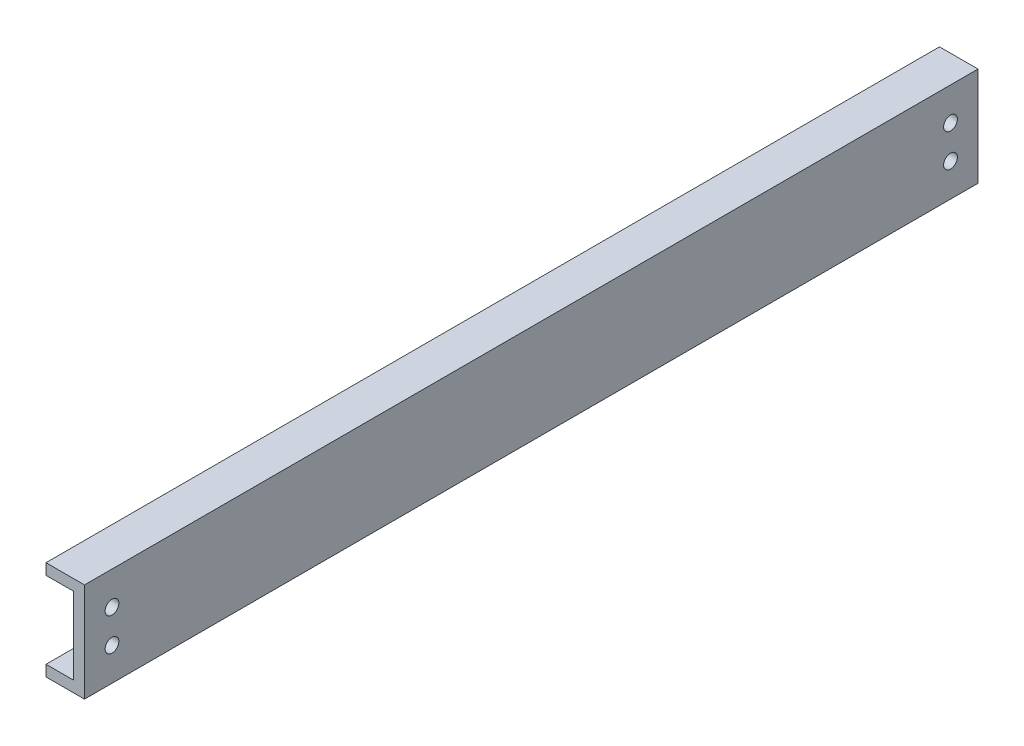
ISO-10303-21;
HEADER;
FILE_DESCRIPTION(('STEP AP214'),'2;1');
FILE_NAME('part.step','',(''),(''),'','','');
FILE_SCHEMA(('AUTOMOTIVE_DESIGN { 1 0 10303 214 1 1 1 1 }'));
ENDSEC;
DATA;
#1=APPLICATION_CONTEXT('core data for automotive mechanical design processes');
#2=APPLICATION_PROTOCOL_DEFINITION('international standard','automotive_design',2000,#1);
#3=PRODUCT_CONTEXT('',#1,'mechanical');
#4=PRODUCT('Part','Part','',(#3));
#5=PRODUCT_RELATED_PRODUCT_CATEGORY('part','',(#4));
#6=PRODUCT_DEFINITION_FORMATION('','',#4);
#7=PRODUCT_DEFINITION_CONTEXT('part definition',#1,'design');
#8=PRODUCT_DEFINITION('design','',#6,#7);
#9=PRODUCT_DEFINITION_SHAPE('','',#8);
#10=(LENGTH_UNIT() NAMED_UNIT(*) SI_UNIT(.MILLI.,.METRE.));
#11=(NAMED_UNIT(*) PLANE_ANGLE_UNIT() SI_UNIT($,.RADIAN.));
#12=(NAMED_UNIT(*) SI_UNIT($,.STERADIAN.) SOLID_ANGLE_UNIT());
#13=UNCERTAINTY_MEASURE_WITH_UNIT(LENGTH_MEASURE(1.E-05),#10,'distance_accuracy_value','');
#14=(GEOMETRIC_REPRESENTATION_CONTEXT(3) GLOBAL_UNCERTAINTY_ASSIGNED_CONTEXT((#13)) GLOBAL_UNIT_ASSIGNED_CONTEXT((#10,
#11,#12)) REPRESENTATION_CONTEXT('',''));
#15=CARTESIAN_POINT('',(0.,0.,0.));
#16=DIRECTION('',(0.,0.,1.));
#17=DIRECTION('',(1.,0.,0.));
#18=AXIS2_PLACEMENT_3D('',#15,#16,#17);
#19=CARTESIAN_POINT('',(-7.,9.88828278471343,-162.5));
#20=DIRECTION('',(-1.,0.,0.));
#21=DIRECTION('',(0.,0.,1.));
#22=AXIS2_PLACEMENT_3D('',#19,#20,#21);
#23=PLANE('',#22);
#24=DIRECTION('',(0.,-1.,0.));
#25=VECTOR('',#24,1.);
#26=CARTESIAN_POINT('',(-7.,9.88828278471343,0.));
#27=LINE('',#26,#25);
#28=CARTESIAN_POINT('',(-7.,9.88828278471343,0.));
#29=VERTEX_POINT('',#28);
#30=CARTESIAN_POINT('',(-7.,7.88828278471343,0.));
#31=VERTEX_POINT('',#30);
#32=EDGE_CURVE('E135',#29,#31,#27,.T.);
#33=ORIENTED_EDGE('',*,*,#32,.F.);
#34=DIRECTION('',(0.,0.,1.));
#35=VECTOR('',#34,1.);
#36=CARTESIAN_POINT('',(-7.,9.88828278471343,-162.5));
#37=LINE('',#36,#35);
#38=CARTESIAN_POINT('',(-7.,9.88828278471343,-162.5));
#39=VERTEX_POINT('',#38);
#40=EDGE_CURVE('E11',#39,#29,#37,.T.);
#41=ORIENTED_EDGE('',*,*,#40,.F.);
#42=DIRECTION('',(0.,-1.,0.));
#43=VECTOR('',#42,1.);
#44=CARTESIAN_POINT('',(-7.,9.88828278471343,-162.5));
#45=LINE('',#44,#43);
#46=CARTESIAN_POINT('',(-7.,7.88828278471343,-162.5));
#47=VERTEX_POINT('',#46);
#48=EDGE_CURVE('E156',#39,#47,#45,.T.);
#49=ORIENTED_EDGE('',*,*,#48,.T.);
#50=DIRECTION('',(0.,0.,1.));
#51=VECTOR('',#50,1.);
#52=CARTESIAN_POINT('',(-7.,7.88828278471343,-162.5));
#53=LINE('',#52,#51);
#54=EDGE_CURVE('E93',#47,#31,#53,.T.);
#55=ORIENTED_EDGE('',*,*,#54,.T.);
#56=EDGE_LOOP('',(#33,#41,#49,#55));
#57=FACE_BOUND('',#56,.T.);
#58=ADVANCED_FACE('F37',(#57),#23,.T.);
#59=CARTESIAN_POINT('',(-7.,9.88828278471343,-162.5));
#60=DIRECTION('',(0.,1.,0.));
#61=DIRECTION('',(-1.,0.,0.));
#62=AXIS2_PLACEMENT_3D('',#59,#60,#61);
#63=PLANE('',#62);
#64=DIRECTION('',(-1.,0.,0.));
#65=VECTOR('',#64,1.);
#66=CARTESIAN_POINT('',(-7.,9.88828278471343,0.));
#67=LINE('',#66,#65);
#68=CARTESIAN_POINT('',(0.,9.88828278471343,0.));
#69=VERTEX_POINT('',#68);
#70=EDGE_CURVE('E154',#69,#29,#67,.T.);
#71=ORIENTED_EDGE('',*,*,#70,.F.);
#72=DIRECTION('',(0.,0.,1.));
#73=VECTOR('',#72,1.);
#74=CARTESIAN_POINT('',(0.,9.88828278471343,-162.5));
#75=LINE('',#74,#73);
#76=CARTESIAN_POINT('',(0.,9.88828278471343,-162.5));
#77=VERTEX_POINT('',#76);
#78=EDGE_CURVE('E46',#77,#69,#75,.T.);
#79=ORIENTED_EDGE('',*,*,#78,.F.);
#80=DIRECTION('',(-1.,0.,0.));
#81=VECTOR('',#80,1.);
#82=CARTESIAN_POINT('',(-7.,9.88828278471343,-162.5));
#83=LINE('',#82,#81);
#84=EDGE_CURVE('E125',#77,#39,#83,.T.);
#85=ORIENTED_EDGE('',*,*,#84,.T.);
#86=ORIENTED_EDGE('',*,*,#40,.T.);
#87=EDGE_LOOP('',(#71,#79,#85,#86));
#88=FACE_BOUND('',#87,.T.);
#89=ADVANCED_FACE('F223',(#88),#63,.T.);
#90=CARTESIAN_POINT('',(0.,9.88828278471343,-162.5));
#91=DIRECTION('',(1.,0.,0.));
#92=DIRECTION('',(0.,1.,0.));
#93=AXIS2_PLACEMENT_3D('',#90,#91,#92);
#94=PLANE('',#93);
#95=CARTESIAN_POINT('',(0.,3.88828278471345,-157.5));
#96=DIRECTION('',(1.,0.,0.));
#97=DIRECTION('',(0.,-1.,0.));
#98=AXIS2_PLACEMENT_3D('',#95,#96,#97);
#99=CIRCLE('',#98,1.25000000000004);
#100=CARTESIAN_POINT('',(0.,2.63828278471341,-157.5));
#101=VERTEX_POINT('',#100);
#102=EDGE_CURVE('E190',#101,#101,#99,.T.);
#103=ORIENTED_EDGE('',*,*,#102,.F.);
#104=EDGE_LOOP('',(#103));
#105=FACE_BOUND('',#104,.T.);
#106=CARTESIAN_POINT('',(0.,-2.11171721528655,-157.5));
#107=DIRECTION('',(1.,0.,0.));
#108=DIRECTION('',(0.,1.,0.));
#109=AXIS2_PLACEMENT_3D('',#106,#107,#108);
#110=CIRCLE('',#109,1.25000000000004);
#111=CARTESIAN_POINT('',(0.,-0.861717215286511,-157.5));
#112=VERTEX_POINT('',#111);
#113=EDGE_CURVE('E194',#112,#112,#110,.T.);
#114=ORIENTED_EDGE('',*,*,#113,.F.);
#115=EDGE_LOOP('',(#114));
#116=FACE_BOUND('',#115,.T.);
#117=CARTESIAN_POINT('',(0.,-2.11171721528657,-5.));
#118=DIRECTION('',(1.,0.,0.));
#119=DIRECTION('',(0.,-1.,0.));
#120=AXIS2_PLACEMENT_3D('',#117,#118,#119);
#121=CIRCLE('',#120,1.25);
#122=CARTESIAN_POINT('',(0.,-3.36171721528657,-5.));
#123=VERTEX_POINT('',#122);
#124=EDGE_CURVE('E199',#123,#123,#121,.T.);
#125=ORIENTED_EDGE('',*,*,#124,.F.);
#126=EDGE_LOOP('',(#125));
#127=FACE_BOUND('',#126,.T.);
#128=CARTESIAN_POINT('',(0.,3.88828278471343,-5.));
#129=DIRECTION('',(1.,0.,0.));
#130=DIRECTION('',(0.,1.,0.));
#131=AXIS2_PLACEMENT_3D('',#128,#129,#130);
#132=CIRCLE('',#131,1.25);
#133=CARTESIAN_POINT('',(0.,5.13828278471343,-5.));
#134=VERTEX_POINT('',#133);
#135=EDGE_CURVE('E171',#134,#134,#132,.T.);
#136=ORIENTED_EDGE('',*,*,#135,.F.);
#137=EDGE_LOOP('',(#136));
#138=FACE_BOUND('',#137,.T.);
#139=DIRECTION('',(0.,1.,0.));
#140=VECTOR('',#139,1.);
#141=CARTESIAN_POINT('',(0.,9.88828278471343,0.));
#142=LINE('',#141,#140);
#143=CARTESIAN_POINT('',(0.,-8.11171721528657,0.));
#144=VERTEX_POINT('',#143);
#145=EDGE_CURVE('E112',#144,#69,#142,.T.);
#146=ORIENTED_EDGE('',*,*,#145,.F.);
#147=DIRECTION('',(0.,0.,1.));
#148=VECTOR('',#147,1.);
#149=CARTESIAN_POINT('',(0.,-8.11171721528657,-162.5));
#150=LINE('',#149,#148);
#151=CARTESIAN_POINT('',(0.,-8.11171721528657,-162.5));
#152=VERTEX_POINT('',#151);
#153=EDGE_CURVE('E107',#152,#144,#150,.T.);
#154=ORIENTED_EDGE('',*,*,#153,.F.);
#155=DIRECTION('',(0.,1.,0.));
#156=VECTOR('',#155,1.);
#157=CARTESIAN_POINT('',(0.,9.88828278471343,-162.5));
#158=LINE('',#157,#156);
#159=EDGE_CURVE('E110',#152,#77,#158,.T.);
#160=ORIENTED_EDGE('',*,*,#159,.T.);
#161=ORIENTED_EDGE('',*,*,#78,.T.);
#162=EDGE_LOOP('',(#146,#154,#160,#161));
#163=FACE_BOUND('',#162,.T.);
#164=ADVANCED_FACE('F109',(#105,#116,#127,#138,#163),#94,.T.);
#165=CARTESIAN_POINT('',(0.,-8.11171721528657,-162.5));
#166=DIRECTION('',(0.,-1.,0.));
#167=DIRECTION('',(1.,0.,0.));
#168=AXIS2_PLACEMENT_3D('',#165,#166,#167);
#169=PLANE('',#168);
#170=CARTESIAN_POINT('',(-4.5,-8.11171721528657,-37.));
#171=DIRECTION('',(0.,-1.,0.));
#172=DIRECTION('',(1.,0.,0.));
#173=AXIS2_PLACEMENT_3D('',#170,#171,#172);
#174=CIRCLE('',#173,1.25);
#175=CARTESIAN_POINT('',(-3.25,-8.11171721528657,-37.));
#176=VERTEX_POINT('',#175);
#177=EDGE_CURVE('E183',#176,#176,#174,.T.);
#178=ORIENTED_EDGE('',*,*,#177,.F.);
#179=EDGE_LOOP('',(#178));
#180=FACE_BOUND('',#179,.T.);
#181=CARTESIAN_POINT('',(-4.5,-8.11171721528657,-43.));
#182=DIRECTION('',(0.,-1.,0.));
#183=DIRECTION('',(-1.,0.,0.));
#184=AXIS2_PLACEMENT_3D('',#181,#182,#183);
#185=CIRCLE('',#184,1.25);
#186=CARTESIAN_POINT('',(-5.75,-8.11171721528657,-43.));
#187=VERTEX_POINT('',#186);
#188=EDGE_CURVE('E289',#187,#187,#185,.T.);
#189=ORIENTED_EDGE('',*,*,#188,.F.);
#190=EDGE_LOOP('',(#189));
#191=FACE_BOUND('',#190,.T.);
#192=CARTESIAN_POINT('',(-4.49999999999999,-8.11171721528657,-112.));
#193=DIRECTION('',(0.,-1.,0.));
#194=DIRECTION('',(1.,0.,0.));
#195=AXIS2_PLACEMENT_3D('',#192,#193,#194);
#196=CIRCLE('',#195,1.25);
#197=CARTESIAN_POINT('',(-3.24999999999999,-8.11171721528657,-112.));
#198=VERTEX_POINT('',#197);
#199=EDGE_CURVE('E292',#198,#198,#196,.T.);
#200=ORIENTED_EDGE('',*,*,#199,.F.);
#201=EDGE_LOOP('',(#200));
#202=FACE_BOUND('',#201,.T.);
#203=CARTESIAN_POINT('',(-4.49999999999999,-8.11171721528657,-118.));
#204=DIRECTION('',(0.,-1.,0.));
#205=DIRECTION('',(-1.,0.,0.));
#206=AXIS2_PLACEMENT_3D('',#203,#204,#205);
#207=CIRCLE('',#206,1.25);
#208=CARTESIAN_POINT('',(-5.74999999999999,-8.11171721528657,-118.));
#209=VERTEX_POINT('',#208);
#210=EDGE_CURVE('E297',#209,#209,#207,.T.);
#211=ORIENTED_EDGE('',*,*,#210,.F.);
#212=EDGE_LOOP('',(#211));
#213=FACE_BOUND('',#212,.T.);
#214=DIRECTION('',(1.,0.,0.));
#215=VECTOR('',#214,1.);
#216=CARTESIAN_POINT('',(0.,-8.11171721528657,0.));
#217=LINE('',#216,#215);
#218=CARTESIAN_POINT('',(-7.,-8.11171721528657,0.));
#219=VERTEX_POINT('',#218);
#220=EDGE_CURVE('E151',#219,#144,#217,.T.);
#221=ORIENTED_EDGE('',*,*,#220,.F.);
#222=DIRECTION('',(0.,0.,1.));
#223=VECTOR('',#222,1.);
#224=CARTESIAN_POINT('',(-7.,-8.11171721528657,-162.5));
#225=LINE('',#224,#223);
#226=CARTESIAN_POINT('',(-7.,-8.11171721528657,-162.5));
#227=VERTEX_POINT('',#226);
#228=EDGE_CURVE('E117',#227,#219,#225,.T.);
#229=ORIENTED_EDGE('',*,*,#228,.F.);
#230=DIRECTION('',(1.,0.,0.));
#231=VECTOR('',#230,1.);
#232=CARTESIAN_POINT('',(0.,-8.11171721528657,-162.5));
#233=LINE('',#232,#231);
#234=EDGE_CURVE('E123',#227,#152,#233,.T.);
#235=ORIENTED_EDGE('',*,*,#234,.T.);
#236=ORIENTED_EDGE('',*,*,#153,.T.);
#237=EDGE_LOOP('',(#221,#229,#235,#236));
#238=FACE_BOUND('',#237,.T.);
#239=ADVANCED_FACE('F127',(#180,#191,#202,#213,#238),#169,.T.);
#240=CARTESIAN_POINT('',(-7.,-8.11171721528657,-162.5));
#241=DIRECTION('',(-1.,0.,0.));
#242=DIRECTION('',(0.,0.,1.));
#243=AXIS2_PLACEMENT_3D('',#240,#241,#242);
#244=PLANE('',#243);
#245=DIRECTION('',(0.,-1.,0.));
#246=VECTOR('',#245,1.);
#247=CARTESIAN_POINT('',(-7.,-8.11171721528657,0.));
#248=LINE('',#247,#246);
#249=CARTESIAN_POINT('',(-7.,-6.11171721528657,0.));
#250=VERTEX_POINT('',#249);
#251=EDGE_CURVE('E148',#250,#219,#248,.T.);
#252=ORIENTED_EDGE('',*,*,#251,.F.);
#253=DIRECTION('',(0.,0.,1.));
#254=VECTOR('',#253,1.);
#255=CARTESIAN_POINT('',(-7.,-6.11171721528657,-162.5));
#256=LINE('',#255,#254);
#257=CARTESIAN_POINT('',(-7.,-6.11171721528657,-162.5));
#258=VERTEX_POINT('',#257);
#259=EDGE_CURVE('E160',#258,#250,#256,.T.);
#260=ORIENTED_EDGE('',*,*,#259,.F.);
#261=DIRECTION('',(0.,-1.,0.));
#262=VECTOR('',#261,1.);
#263=CARTESIAN_POINT('',(-7.,-8.11171721528657,-162.5));
#264=LINE('',#263,#262);
#265=EDGE_CURVE('E128',#258,#227,#264,.T.);
#266=ORIENTED_EDGE('',*,*,#265,.T.);
#267=ORIENTED_EDGE('',*,*,#228,.T.);
#268=EDGE_LOOP('',(#252,#260,#266,#267));
#269=FACE_BOUND('',#268,.T.);
#270=ADVANCED_FACE('F237',(#269),#244,.T.);
#271=CARTESIAN_POINT('',(-2.,-6.11171721528657,-162.5));
#272=DIRECTION('',(0.,1.,0.));
#273=DIRECTION('',(0.,0.,1.));
#274=AXIS2_PLACEMENT_3D('',#271,#272,#273);
#275=PLANE('',#274);
#276=CARTESIAN_POINT('',(-4.49999999999999,-6.11171721528657,-37.));
#277=DIRECTION('',(0.,1.,0.));
#278=DIRECTION('',(0.,0.,1.));
#279=AXIS2_PLACEMENT_3D('',#276,#277,#278);
#280=CIRCLE('',#279,1.25);
#281=CARTESIAN_POINT('',(-4.49999999999999,-6.11171721528657,-35.75));
#282=VERTEX_POINT('',#281);
#283=EDGE_CURVE('E40',#282,#282,#280,.T.);
#284=ORIENTED_EDGE('',*,*,#283,.F.);
#285=EDGE_LOOP('',(#284));
#286=FACE_BOUND('',#285,.T.);
#287=CARTESIAN_POINT('',(-4.49999999999999,-6.11171721528657,-43.));
#288=DIRECTION('',(0.,1.,0.));
#289=DIRECTION('',(0.,0.,1.));
#290=AXIS2_PLACEMENT_3D('',#287,#288,#289);
#291=CIRCLE('',#290,1.25);
#292=CARTESIAN_POINT('',(-4.49999999999999,-6.11171721528657,-41.75));
#293=VERTEX_POINT('',#292);
#294=EDGE_CURVE('E185',#293,#293,#291,.T.);
#295=ORIENTED_EDGE('',*,*,#294,.F.);
#296=EDGE_LOOP('',(#295));
#297=FACE_BOUND('',#296,.T.);
#298=CARTESIAN_POINT('',(-4.49999999999998,-6.11171721528657,-112.));
#299=DIRECTION('',(0.,1.,0.));
#300=DIRECTION('',(0.,0.,1.));
#301=AXIS2_PLACEMENT_3D('',#298,#299,#300);
#302=CIRCLE('',#301,1.25);
#303=CARTESIAN_POINT('',(-4.49999999999998,-6.11171721528657,-110.75));
#304=VERTEX_POINT('',#303);
#305=EDGE_CURVE('E182',#304,#304,#302,.T.);
#306=ORIENTED_EDGE('',*,*,#305,.F.);
#307=EDGE_LOOP('',(#306));
#308=FACE_BOUND('',#307,.T.);
#309=CARTESIAN_POINT('',(-4.49999999999998,-6.11171721528657,-118.));
#310=DIRECTION('',(0.,1.,0.));
#311=DIRECTION('',(0.,0.,1.));
#312=AXIS2_PLACEMENT_3D('',#309,#310,#311);
#313=CIRCLE('',#312,1.25);
#314=CARTESIAN_POINT('',(-4.49999999999998,-6.11171721528657,-116.75));
#315=VERTEX_POINT('',#314);
#316=EDGE_CURVE('E179',#315,#315,#313,.T.);
#317=ORIENTED_EDGE('',*,*,#316,.F.);
#318=EDGE_LOOP('',(#317));
#319=FACE_BOUND('',#318,.T.);
#320=DIRECTION('',(-1.,0.,0.));
#321=VECTOR('',#320,1.);
#322=CARTESIAN_POINT('',(-2.,-6.11171721528657,0.));
#323=LINE('',#322,#321);
#324=CARTESIAN_POINT('',(-2.,-6.11171721528657,0.));
#325=VERTEX_POINT('',#324);
#326=EDGE_CURVE('E145',#325,#250,#323,.T.);
#327=ORIENTED_EDGE('',*,*,#326,.F.);
#328=DIRECTION('',(0.,0.,1.));
#329=VECTOR('',#328,1.);
#330=CARTESIAN_POINT('',(-2.,-6.11171721528657,-162.5));
#331=LINE('',#330,#329);
#332=CARTESIAN_POINT('',(-2.,-6.11171721528657,-162.5));
#333=VERTEX_POINT('',#332);
#334=EDGE_CURVE('E162',#333,#325,#331,.T.);
#335=ORIENTED_EDGE('',*,*,#334,.F.);
#336=DIRECTION('',(-1.,0.,0.));
#337=VECTOR('',#336,1.);
#338=CARTESIAN_POINT('',(-2.,-6.11171721528657,-162.5));
#339=LINE('',#338,#337);
#340=EDGE_CURVE('E130',#333,#258,#339,.T.);
#341=ORIENTED_EDGE('',*,*,#340,.T.);
#342=ORIENTED_EDGE('',*,*,#259,.T.);
#343=EDGE_LOOP('',(#327,#335,#341,#342));
#344=FACE_BOUND('',#343,.T.);
#345=ADVANCED_FACE('F214',(#286,#297,#308,#319,#344),#275,.T.);
#346=CARTESIAN_POINT('',(-2.,7.88828278471343,-162.5));
#347=DIRECTION('',(-1.,0.,0.));
#348=DIRECTION('',(0.,-1.,0.));
#349=AXIS2_PLACEMENT_3D('',#346,#347,#348);
#350=PLANE('',#349);
#351=CARTESIAN_POINT('',(-2.,3.88828278471345,-157.5));
#352=DIRECTION('',(-1.,0.,0.));
#353=DIRECTION('',(0.,-1.,0.));
#354=AXIS2_PLACEMENT_3D('',#351,#352,#353);
#355=CIRCLE('',#354,1.25000000000004);
#356=CARTESIAN_POINT('',(-2.,2.63828278471341,-157.5));
#357=VERTEX_POINT('',#356);
#358=EDGE_CURVE('E139',#357,#357,#355,.T.);
#359=ORIENTED_EDGE('',*,*,#358,.F.);
#360=EDGE_LOOP('',(#359));
#361=FACE_BOUND('',#360,.T.);
#362=CARTESIAN_POINT('',(-2.,-2.11171721528655,-157.5));
#363=DIRECTION('',(-1.,0.,0.));
#364=DIRECTION('',(0.,-1.,0.));
#365=AXIS2_PLACEMENT_3D('',#362,#363,#364);
#366=CIRCLE('',#365,1.25000000000004);
#367=CARTESIAN_POINT('',(-2.,-3.36171721528659,-157.5));
#368=VERTEX_POINT('',#367);
#369=EDGE_CURVE('E174',#368,#368,#366,.T.);
#370=ORIENTED_EDGE('',*,*,#369,.F.);
#371=EDGE_LOOP('',(#370));
#372=FACE_BOUND('',#371,.T.);
#373=CARTESIAN_POINT('',(-2.,-2.11171721528657,-5.));
#374=DIRECTION('',(-1.,0.,0.));
#375=DIRECTION('',(0.,-1.,0.));
#376=AXIS2_PLACEMENT_3D('',#373,#374,#375);
#377=CIRCLE('',#376,1.25);
#378=CARTESIAN_POINT('',(-2.,-3.36171721528657,-5.));
#379=VERTEX_POINT('',#378);
#380=EDGE_CURVE('E170',#379,#379,#377,.T.);
#381=ORIENTED_EDGE('',*,*,#380,.F.);
#382=EDGE_LOOP('',(#381));
#383=FACE_BOUND('',#382,.T.);
#384=CARTESIAN_POINT('',(-2.,3.88828278471343,-5.));
#385=DIRECTION('',(-1.,0.,0.));
#386=DIRECTION('',(0.,-1.,0.));
#387=AXIS2_PLACEMENT_3D('',#384,#385,#386);
#388=CIRCLE('',#387,1.25);
#389=CARTESIAN_POINT('',(-2.,2.63828278471343,-5.));
#390=VERTEX_POINT('',#389);
#391=EDGE_CURVE('E167',#390,#390,#388,.T.);
#392=ORIENTED_EDGE('',*,*,#391,.F.);
#393=EDGE_LOOP('',(#392));
#394=FACE_BOUND('',#393,.T.);
#395=DIRECTION('',(0.,-1.,0.));
#396=VECTOR('',#395,1.);
#397=CARTESIAN_POINT('',(-2.,7.88828278471343,0.));
#398=LINE('',#397,#396);
#399=CARTESIAN_POINT('',(-2.,7.88828278471343,0.));
#400=VERTEX_POINT('',#399);
#401=EDGE_CURVE('E142',#400,#325,#398,.T.);
#402=ORIENTED_EDGE('',*,*,#401,.F.);
#403=DIRECTION('',(0.,0.,1.));
#404=VECTOR('',#403,1.);
#405=CARTESIAN_POINT('',(-2.,7.88828278471343,-162.5));
#406=LINE('',#405,#404);
#407=CARTESIAN_POINT('',(-2.,7.88828278471343,-162.5));
#408=VERTEX_POINT('',#407);
#409=EDGE_CURVE('E164',#408,#400,#406,.T.);
#410=ORIENTED_EDGE('',*,*,#409,.F.);
#411=DIRECTION('',(0.,-1.,0.));
#412=VECTOR('',#411,1.);
#413=CARTESIAN_POINT('',(-2.,7.88828278471343,-162.5));
#414=LINE('',#413,#412);
#415=EDGE_CURVE('E208',#408,#333,#414,.T.);
#416=ORIENTED_EDGE('',*,*,#415,.T.);
#417=ORIENTED_EDGE('',*,*,#334,.T.);
#418=EDGE_LOOP('',(#402,#410,#416,#417));
#419=FACE_BOUND('',#418,.T.);
#420=ADVANCED_FACE('F219',(#361,#372,#383,#394,#419),#350,.T.);
#421=CARTESIAN_POINT('',(-7.,7.88828278471343,-162.5));
#422=DIRECTION('',(0.,-1.,0.));
#423=DIRECTION('',(0.,0.,-1.));
#424=AXIS2_PLACEMENT_3D('',#421,#422,#423);
#425=PLANE('',#424);
#426=DIRECTION('',(1.,0.,0.));
#427=VECTOR('',#426,1.);
#428=CARTESIAN_POINT('',(-7.,7.88828278471343,0.));
#429=LINE('',#428,#427);
#430=EDGE_CURVE('E138',#31,#400,#429,.T.);
#431=ORIENTED_EDGE('',*,*,#430,.F.);
#432=ORIENTED_EDGE('',*,*,#54,.F.);
#433=DIRECTION('',(1.,0.,0.));
#434=VECTOR('',#433,1.);
#435=CARTESIAN_POINT('',(-7.,7.88828278471343,-162.5));
#436=LINE('',#435,#434);
#437=EDGE_CURVE('E206',#47,#408,#436,.T.);
#438=ORIENTED_EDGE('',*,*,#437,.T.);
#439=ORIENTED_EDGE('',*,*,#409,.T.);
#440=EDGE_LOOP('',(#431,#432,#438,#439));
#441=FACE_BOUND('',#440,.T.);
#442=ADVANCED_FACE('F220',(#441),#425,.T.);
#443=CARTESIAN_POINT('',(0.,0.,-162.5));
#444=DIRECTION('',(0.,0.,1.));
#445=DIRECTION('',(1.,0.,0.));
#446=AXIS2_PLACEMENT_3D('',#443,#444,#445);
#447=PLANE('',#446);
#448=ORIENTED_EDGE('',*,*,#48,.F.);
#449=ORIENTED_EDGE('',*,*,#84,.F.);
#450=ORIENTED_EDGE('',*,*,#159,.F.);
#451=ORIENTED_EDGE('',*,*,#234,.F.);
#452=ORIENTED_EDGE('',*,*,#265,.F.);
#453=ORIENTED_EDGE('',*,*,#340,.F.);
#454=ORIENTED_EDGE('',*,*,#415,.F.);
#455=ORIENTED_EDGE('',*,*,#437,.F.);
#456=EDGE_LOOP('',(#448,#449,#450,#451,#452,#453,#454,#455));
#457=FACE_BOUND('',#456,.T.);
#458=ADVANCED_FACE('F121',(#457),#447,.F.);
#459=CARTESIAN_POINT('',(0.,0.,0.));
#460=DIRECTION('',(0.,0.,1.));
#461=DIRECTION('',(1.,0.,0.));
#462=AXIS2_PLACEMENT_3D('',#459,#460,#461);
#463=PLANE('',#462);
#464=ORIENTED_EDGE('',*,*,#32,.T.);
#465=ORIENTED_EDGE('',*,*,#430,.T.);
#466=ORIENTED_EDGE('',*,*,#401,.T.);
#467=ORIENTED_EDGE('',*,*,#326,.T.);
#468=ORIENTED_EDGE('',*,*,#251,.T.);
#469=ORIENTED_EDGE('',*,*,#220,.T.);
#470=ORIENTED_EDGE('',*,*,#145,.T.);
#471=ORIENTED_EDGE('',*,*,#70,.T.);
#472=EDGE_LOOP('',(#464,#465,#466,#467,#468,#469,#470,#471));
#473=FACE_BOUND('',#472,.T.);
#474=ADVANCED_FACE('F222',(#473),#463,.T.);
#475=CARTESIAN_POINT('',(-7.,3.88828278471343,-5.));
#476=DIRECTION('',(1.,0.,0.));
#477=DIRECTION('',(0.,1.,0.));
#478=AXIS2_PLACEMENT_3D('',#475,#476,#477);
#479=CYLINDRICAL_SURFACE('',#478,1.25);
#480=ORIENTED_EDGE('',*,*,#391,.T.);
#481=EDGE_LOOP('',(#480));
#482=FACE_BOUND('',#481,.T.);
#483=ORIENTED_EDGE('',*,*,#135,.T.);
#484=EDGE_LOOP('',(#483));
#485=FACE_BOUND('',#484,.T.);
#486=ADVANCED_FACE('F254',(#482,#485),#479,.F.);
#487=CARTESIAN_POINT('',(-7.,-2.11171721528657,-5.));
#488=DIRECTION('',(1.,0.,0.));
#489=DIRECTION('',(0.,1.,0.));
#490=AXIS2_PLACEMENT_3D('',#487,#488,#489);
#491=CYLINDRICAL_SURFACE('',#490,1.25);
#492=ORIENTED_EDGE('',*,*,#380,.T.);
#493=EDGE_LOOP('',(#492));
#494=FACE_BOUND('',#493,.T.);
#495=ORIENTED_EDGE('',*,*,#124,.T.);
#496=EDGE_LOOP('',(#495));
#497=FACE_BOUND('',#496,.T.);
#498=ADVANCED_FACE('F258',(#494,#497),#491,.F.);
#499=CARTESIAN_POINT('',(-7.,-2.11171721528655,-157.5));
#500=DIRECTION('',(1.,0.,0.));
#501=DIRECTION('',(0.,1.,0.));
#502=AXIS2_PLACEMENT_3D('',#499,#500,#501);
#503=CYLINDRICAL_SURFACE('',#502,1.25000000000004);
#504=ORIENTED_EDGE('',*,*,#369,.T.);
#505=EDGE_LOOP('',(#504));
#506=FACE_BOUND('',#505,.T.);
#507=ORIENTED_EDGE('',*,*,#113,.T.);
#508=EDGE_LOOP('',(#507));
#509=FACE_BOUND('',#508,.T.);
#510=ADVANCED_FACE('F264',(#506,#509),#503,.F.);
#511=CARTESIAN_POINT('',(-7.,3.88828278471345,-157.5));
#512=DIRECTION('',(1.,0.,0.));
#513=DIRECTION('',(0.,1.,0.));
#514=AXIS2_PLACEMENT_3D('',#511,#512,#513);
#515=CYLINDRICAL_SURFACE('',#514,1.25000000000004);
#516=ORIENTED_EDGE('',*,*,#358,.T.);
#517=EDGE_LOOP('',(#516));
#518=FACE_BOUND('',#517,.T.);
#519=ORIENTED_EDGE('',*,*,#102,.T.);
#520=EDGE_LOOP('',(#519));
#521=FACE_BOUND('',#520,.T.);
#522=ADVANCED_FACE('F260',(#518,#521),#515,.F.);
#523=CARTESIAN_POINT('',(-4.49999999999998,1.88828278471343,-118.));
#524=DIRECTION('',(0.,-1.,0.));
#525=DIRECTION('',(1.,0.,0.));
#526=AXIS2_PLACEMENT_3D('',#523,#524,#525);
#527=CYLINDRICAL_SURFACE('',#526,1.25);
#528=ORIENTED_EDGE('',*,*,#316,.T.);
#529=EDGE_LOOP('',(#528));
#530=FACE_BOUND('',#529,.T.);
#531=ORIENTED_EDGE('',*,*,#210,.T.);
#532=EDGE_LOOP('',(#531));
#533=FACE_BOUND('',#532,.T.);
#534=ADVANCED_FACE('F263',(#530,#533),#527,.F.);
#535=CARTESIAN_POINT('',(-4.49999999999998,1.88828278471343,-112.));
#536=DIRECTION('',(0.,-1.,0.));
#537=DIRECTION('',(1.,0.,0.));
#538=AXIS2_PLACEMENT_3D('',#535,#536,#537);
#539=CYLINDRICAL_SURFACE('',#538,1.25);
#540=ORIENTED_EDGE('',*,*,#305,.T.);
#541=EDGE_LOOP('',(#540));
#542=FACE_BOUND('',#541,.T.);
#543=ORIENTED_EDGE('',*,*,#199,.T.);
#544=EDGE_LOOP('',(#543));
#545=FACE_BOUND('',#544,.T.);
#546=ADVANCED_FACE('F274',(#542,#545),#539,.F.);
#547=CARTESIAN_POINT('',(-4.49999999999999,1.88828278471343,-43.));
#548=DIRECTION('',(0.,-1.,0.));
#549=DIRECTION('',(1.,0.,0.));
#550=AXIS2_PLACEMENT_3D('',#547,#548,#549);
#551=CYLINDRICAL_SURFACE('',#550,1.25);
#552=ORIENTED_EDGE('',*,*,#294,.T.);
#553=EDGE_LOOP('',(#552));
#554=FACE_BOUND('',#553,.T.);
#555=ORIENTED_EDGE('',*,*,#188,.T.);
#556=EDGE_LOOP('',(#555));
#557=FACE_BOUND('',#556,.T.);
#558=ADVANCED_FACE('F278',(#554,#557),#551,.F.);
#559=CARTESIAN_POINT('',(-4.49999999999999,1.88828278471343,-37.));
#560=DIRECTION('',(0.,-1.,0.));
#561=DIRECTION('',(1.,0.,0.));
#562=AXIS2_PLACEMENT_3D('',#559,#560,#561);
#563=CYLINDRICAL_SURFACE('',#562,1.25);
#564=ORIENTED_EDGE('',*,*,#283,.T.);
#565=EDGE_LOOP('',(#564));
#566=FACE_BOUND('',#565,.T.);
#567=ORIENTED_EDGE('',*,*,#177,.T.);
#568=EDGE_LOOP('',(#567));
#569=FACE_BOUND('',#568,.T.);
#570=ADVANCED_FACE('F282',(#566,#569),#563,.F.);
#571=CLOSED_SHELL('',(#58,#89,#164,#239,#270,#345,#420,#442,#458,#474,#486,#498,#510,#522,#534,
#546,#558,#570));
#572=MANIFOLD_SOLID_BREP('B2',#571);
#573=ADVANCED_BREP_SHAPE_REPRESENTATION('',(#18,#572),#14);
#574=SHAPE_DEFINITION_REPRESENTATION(#9,#573);
ENDSEC;
END-ISO-10303-21;
